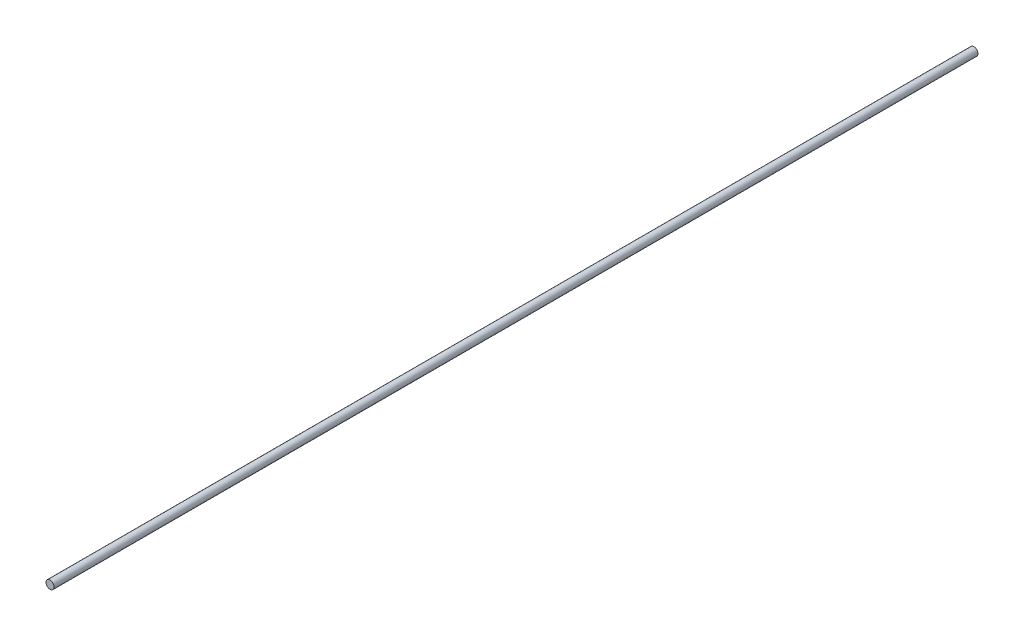
ISO-10303-21;
HEADER;
FILE_DESCRIPTION(('STEP AP214'),'2;1');
FILE_NAME('part.step','',(''),(''),'','','');
FILE_SCHEMA(('AUTOMOTIVE_DESIGN { 1 0 10303 214 1 1 1 1 }'));
ENDSEC;
DATA;
#1=APPLICATION_CONTEXT('core data for automotive mechanical design processes');
#2=APPLICATION_PROTOCOL_DEFINITION('international standard','automotive_design',2000,#1);
#3=PRODUCT_CONTEXT('',#1,'mechanical');
#4=PRODUCT('Part','Part','',(#3));
#5=PRODUCT_RELATED_PRODUCT_CATEGORY('part','',(#4));
#6=PRODUCT_DEFINITION_FORMATION('','',#4);
#7=PRODUCT_DEFINITION_CONTEXT('part definition',#1,'design');
#8=PRODUCT_DEFINITION('design','',#6,#7);
#9=PRODUCT_DEFINITION_SHAPE('','',#8);
#10=(LENGTH_UNIT() NAMED_UNIT(*) SI_UNIT(.MILLI.,.METRE.));
#11=(NAMED_UNIT(*) PLANE_ANGLE_UNIT() SI_UNIT($,.RADIAN.));
#12=(NAMED_UNIT(*) SI_UNIT($,.STERADIAN.) SOLID_ANGLE_UNIT());
#13=UNCERTAINTY_MEASURE_WITH_UNIT(LENGTH_MEASURE(1.E-05),#10,'distance_accuracy_value','');
#14=(GEOMETRIC_REPRESENTATION_CONTEXT(3) GLOBAL_UNCERTAINTY_ASSIGNED_CONTEXT((#13)) GLOBAL_UNIT_ASSIGNED_CONTEXT((#10,
#11,#12)) REPRESENTATION_CONTEXT('',''));
#15=CARTESIAN_POINT('',(0.,0.,0.));
#16=DIRECTION('',(0.,0.,1.));
#17=DIRECTION('',(1.,0.,0.));
#18=AXIS2_PLACEMENT_3D('',#15,#16,#17);
#19=CARTESIAN_POINT('',(0.,0.,914.4));
#20=DIRECTION('',(0.,0.,-1.));
#21=DIRECTION('',(-1.,0.,0.));
#22=AXIS2_PLACEMENT_3D('',#19,#20,#21);
#23=CYLINDRICAL_SURFACE('',#22,4.);
#24=CARTESIAN_POINT('',(0.,0.,914.4));
#25=DIRECTION('',(0.,0.,1.));
#26=DIRECTION('',(1.,0.,0.));
#27=AXIS2_PLACEMENT_3D('',#24,#25,#26);
#28=CIRCLE('',#27,4.);
#29=CARTESIAN_POINT('',(4.,0.,914.4));
#30=VERTEX_POINT('',#29);
#31=EDGE_CURVE('E10',#30,#30,#28,.T.);
#32=ORIENTED_EDGE('',*,*,#31,.F.);
#33=EDGE_LOOP('',(#32));
#34=FACE_BOUND('',#33,.T.);
#35=CARTESIAN_POINT('',(0.,0.,0.));
#36=DIRECTION('',(0.,0.,1.));
#37=DIRECTION('',(1.,0.,0.));
#38=AXIS2_PLACEMENT_3D('',#35,#36,#37);
#39=CIRCLE('',#38,4.);
#40=CARTESIAN_POINT('',(4.,0.,0.));
#41=VERTEX_POINT('',#40);
#42=EDGE_CURVE('E39',#41,#41,#39,.T.);
#43=ORIENTED_EDGE('',*,*,#42,.T.);
#44=EDGE_LOOP('',(#43));
#45=FACE_BOUND('',#44,.T.);
#46=ADVANCED_FACE('F36',(#34,#45),#23,.T.);
#47=CARTESIAN_POINT('',(0.,0.,914.4));
#48=DIRECTION('',(0.,0.,1.));
#49=DIRECTION('',(1.,0.,0.));
#50=AXIS2_PLACEMENT_3D('',#47,#48,#49);
#51=PLANE('',#50);
#52=ORIENTED_EDGE('',*,*,#31,.T.);
#53=EDGE_LOOP('',(#52));
#54=FACE_BOUND('',#53,.T.);
#55=ADVANCED_FACE('F53',(#54),#51,.T.);
#56=CARTESIAN_POINT('',(0.,0.,0.));
#57=DIRECTION('',(0.,0.,1.));
#58=DIRECTION('',(1.,0.,0.));
#59=AXIS2_PLACEMENT_3D('',#56,#57,#58);
#60=PLANE('',#59);
#61=ORIENTED_EDGE('',*,*,#42,.F.);
#62=EDGE_LOOP('',(#61));
#63=FACE_BOUND('',#62,.T.);
#64=ADVANCED_FACE('F51',(#63),#60,.F.);
#65=CLOSED_SHELL('',(#46,#55,#64));
#66=MANIFOLD_SOLID_BREP('B2',#65);
#67=ADVANCED_BREP_SHAPE_REPRESENTATION('',(#18,#66),#14);
#68=SHAPE_DEFINITION_REPRESENTATION(#9,#67);
ENDSEC;
END-ISO-10303-21;
